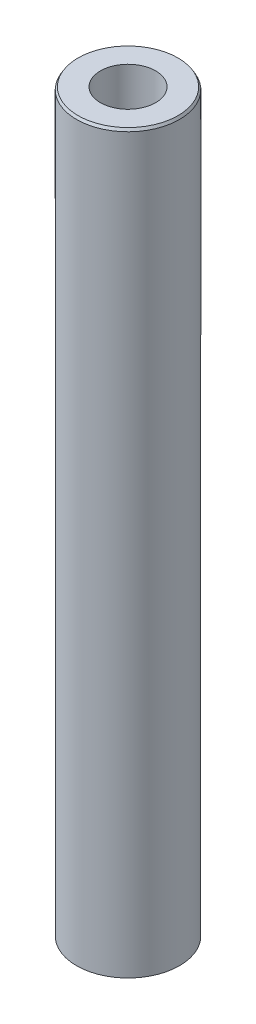
ISO-10303-21;
HEADER;
FILE_DESCRIPTION(('STEP AP214'),'2;1');
FILE_NAME('part.step','',(''),(''),'','','');
FILE_SCHEMA(('AUTOMOTIVE_DESIGN { 1 0 10303 214 1 1 1 1 }'));
ENDSEC;
DATA;
#1=APPLICATION_CONTEXT('core data for automotive mechanical design processes');
#2=APPLICATION_PROTOCOL_DEFINITION('international standard','automotive_design',2000,#1);
#3=PRODUCT_CONTEXT('',#1,'mechanical');
#4=PRODUCT('Part','Part','',(#3));
#5=PRODUCT_RELATED_PRODUCT_CATEGORY('part','',(#4));
#6=PRODUCT_DEFINITION_FORMATION('','',#4);
#7=PRODUCT_DEFINITION_CONTEXT('part definition',#1,'design');
#8=PRODUCT_DEFINITION('design','',#6,#7);
#9=PRODUCT_DEFINITION_SHAPE('','',#8);
#10=(LENGTH_UNIT() NAMED_UNIT(*) SI_UNIT(.MILLI.,.METRE.));
#11=(NAMED_UNIT(*) PLANE_ANGLE_UNIT() SI_UNIT($,.RADIAN.));
#12=(NAMED_UNIT(*) SI_UNIT($,.STERADIAN.) SOLID_ANGLE_UNIT());
#13=UNCERTAINTY_MEASURE_WITH_UNIT(LENGTH_MEASURE(1.E-05),#10,'distance_accuracy_value','');
#14=(GEOMETRIC_REPRESENTATION_CONTEXT(3) GLOBAL_UNCERTAINTY_ASSIGNED_CONTEXT((#13)) GLOBAL_UNIT_ASSIGNED_CONTEXT((#10,
#11,#12)) REPRESENTATION_CONTEXT('',''));
#15=CARTESIAN_POINT('',(0.,0.,0.));
#16=DIRECTION('',(0.,0.,1.));
#17=DIRECTION('',(1.,0.,0.));
#18=AXIS2_PLACEMENT_3D('',#15,#16,#17);
#19=CARTESIAN_POINT('',(0.,536.810664928625,0.));
#20=DIRECTION('',(0.,-1.,0.));
#21=DIRECTION('',(0.,0.,-1.));
#22=AXIS2_PLACEMENT_3D('',#19,#20,#21);
#23=CYLINDRICAL_SURFACE('',#22,37.5);
#24=CARTESIAN_POINT('',(0.,534.919867505079,0.));
#25=DIRECTION('',(0.,1.,0.));
#26=DIRECTION('',(0.,0.,1.));
#27=AXIS2_PLACEMENT_3D('',#24,#25,#26);
#28=CIRCLE('',#27,37.5);
#29=CARTESIAN_POINT('',(0.,534.919867505079,-37.5));
#30=VERTEX_POINT('',#29);
#31=EDGE_CURVE('E50',#30,#30,#28,.F.);
#32=ORIENTED_EDGE('',*,*,#31,.T.);
#33=EDGE_LOOP('',(#32));
#34=FACE_BOUND('',#33,.T.);
#35=CARTESIAN_POINT('',(0.,1.09165240146714,0.));
#36=DIRECTION('',(0.,1.,0.));
#37=DIRECTION('',(0.,0.,1.));
#38=AXIS2_PLACEMENT_3D('',#35,#36,#37);
#39=CIRCLE('',#38,37.5);
#40=CARTESIAN_POINT('',(0.,1.09165240146714,37.5));
#41=VERTEX_POINT('',#40);
#42=EDGE_CURVE('E51',#41,#41,#39,.T.);
#43=ORIENTED_EDGE('',*,*,#42,.T.);
#44=EDGE_LOOP('',(#43));
#45=FACE_BOUND('',#44,.T.);
#46=ADVANCED_FACE('F39',(#34,#45),#23,.T.);
#47=CARTESIAN_POINT('',(0.,536.810664928625,0.));
#48=DIRECTION('',(0.,1.,0.));
#49=DIRECTION('',(0.,0.,1.));
#50=AXIS2_PLACEMENT_3D('',#47,#48,#49);
#51=PLANE('',#50);
#52=CARTESIAN_POINT('',(0.,536.810664928625,0.));
#53=DIRECTION('',(0.,1.,0.));
#54=DIRECTION('',(0.,0.,1.));
#55=AXIS2_PLACEMENT_3D('',#52,#53,#54);
#56=CIRCLE('',#55,36.4083475985327);
#57=CARTESIAN_POINT('',(0.,536.810664928625,-36.4083475985328));
#58=VERTEX_POINT('',#57);
#59=EDGE_CURVE('E54',#58,#58,#56,.T.);
#60=ORIENTED_EDGE('',*,*,#59,.T.);
#61=EDGE_LOOP('',(#60));
#62=FACE_BOUND('',#61,.T.);
#63=CARTESIAN_POINT('',(0.,536.810664928625,0.));
#64=DIRECTION('',(0.,1.,0.));
#65=DIRECTION('',(0.,0.,1.));
#66=AXIS2_PLACEMENT_3D('',#63,#64,#65);
#67=CIRCLE('',#66,20.1042191089184);
#68=CARTESIAN_POINT('',(0.,536.810664928625,20.1042191089184));
#69=VERTEX_POINT('',#68);
#70=EDGE_CURVE('E58',#69,#69,#67,.T.);
#71=ORIENTED_EDGE('',*,*,#70,.F.);
#72=EDGE_LOOP('',(#71));
#73=FACE_BOUND('',#72,.T.);
#74=ADVANCED_FACE('F69',(#62,#73),#51,.T.);
#75=CARTESIAN_POINT('',(0.,0.,0.));
#76=DIRECTION('',(0.,1.,0.));
#77=DIRECTION('',(0.,0.,1.));
#78=AXIS2_PLACEMENT_3D('',#75,#76,#77);
#79=PLANE('',#78);
#80=CARTESIAN_POINT('',(0.,0.,0.));
#81=DIRECTION('',(0.,1.,0.));
#82=DIRECTION('',(0.,0.,1.));
#83=AXIS2_PLACEMENT_3D('',#80,#81,#82);
#84=CIRCLE('',#83,35.6092025764543);
#85=CARTESIAN_POINT('',(0.,0.,35.6092025764543));
#86=VERTEX_POINT('',#85);
#87=EDGE_CURVE('E10',#86,#86,#84,.F.);
#88=ORIENTED_EDGE('',*,*,#87,.T.);
#89=EDGE_LOOP('',(#88));
#90=FACE_BOUND('',#89,.T.);
#91=CARTESIAN_POINT('',(0.,0.,0.));
#92=DIRECTION('',(0.,1.,0.));
#93=DIRECTION('',(0.,0.,1.));
#94=AXIS2_PLACEMENT_3D('',#91,#92,#93);
#95=CIRCLE('',#94,20.1042191089184);
#96=CARTESIAN_POINT('',(0.,0.,20.1042191089184));
#97=VERTEX_POINT('',#96);
#98=EDGE_CURVE('E63',#97,#97,#95,.T.);
#99=ORIENTED_EDGE('',*,*,#98,.T.);
#100=EDGE_LOOP('',(#99));
#101=FACE_BOUND('',#100,.T.);
#102=ADVANCED_FACE('F75',(#90,#101),#79,.F.);
#103=CARTESIAN_POINT('',(0.,536.810664928625,0.));
#104=DIRECTION('',(0.,-1.,0.));
#105=DIRECTION('',(0.,0.,-1.));
#106=AXIS2_PLACEMENT_3D('',#103,#104,#105);
#107=CYLINDRICAL_SURFACE('',#106,20.1042191089184);
#108=ORIENTED_EDGE('',*,*,#70,.T.);
#109=EDGE_LOOP('',(#108));
#110=FACE_BOUND('',#109,.T.);
#111=ORIENTED_EDGE('',*,*,#98,.F.);
#112=EDGE_LOOP('',(#111));
#113=FACE_BOUND('',#112,.T.);
#114=ADVANCED_FACE('F70',(#110,#113),#107,.F.);
#115=CARTESIAN_POINT('',(0.,536.810664928625,0.));
#116=DIRECTION('',(0.,-1.,0.));
#117=DIRECTION('',(0.,0.,-1.));
#118=AXIS2_PLACEMENT_3D('',#115,#116,#117);
#119=CONICAL_SURFACE('',#118,36.4083475985327,0.523598775598319);
#120=CARTESIAN_POINT('',(0.,534.919867505079,-37.5));
#121=CARTESIAN_POINT('',(0.,534.939563311575,-37.4886286208181));
#122=CARTESIAN_POINT('',(0.,534.95925911807,-37.4772572416361));
#123=CARTESIAN_POINT('',(0.,534.998650731061,-37.4545144832722));
#124=CARTESIAN_POINT('',(0.,535.018346537556,-37.4431431040903));
#125=CARTESIAN_POINT('',(0.,535.057738150546,-37.4204003457264));
#126=CARTESIAN_POINT('',(0.,535.077433957042,-37.4090289665444));
#127=CARTESIAN_POINT('',(0.,535.116825570032,-37.3862862081805));
#128=CARTESIAN_POINT('',(0.,535.136521376527,-37.3749148289986));
#129=CARTESIAN_POINT('',(0.,535.175912989518,-37.3521720706347));
#130=CARTESIAN_POINT('',(0.,535.195608796013,-37.3408006914527));
#131=CARTESIAN_POINT('',(0.,535.235000409004,-37.3180579330888));
#132=CARTESIAN_POINT('',(0.,535.254696215499,-37.3066865539069));
#133=CARTESIAN_POINT('',(0.,535.29408782849,-37.283943795543));
#134=CARTESIAN_POINT('',(0.,535.313783634985,-37.272572416361));
#135=CARTESIAN_POINT('',(0.,535.353175247975,-37.2498296579971));
#136=CARTESIAN_POINT('',(0.,535.37287105447,-37.2384582788152));
#137=CARTESIAN_POINT('',(0.,535.412262667461,-37.2157155204513));
#138=CARTESIAN_POINT('',(0.,535.431958473956,-37.2043441412693));
#139=CARTESIAN_POINT('',(0.,535.471350086947,-37.1816013829054));
#140=CARTESIAN_POINT('',(0.,535.491045893442,-37.1702300037235));
#141=CARTESIAN_POINT('',(0.,535.530437506433,-37.1474872453596));
#142=CARTESIAN_POINT('',(0.,535.550133312928,-37.1361158661776));
#143=CARTESIAN_POINT('',(0.,535.589524925919,-37.1133731078137));
#144=CARTESIAN_POINT('',(0.,535.609220732414,-37.1020017286318));
#145=CARTESIAN_POINT('',(0.,535.648612345404,-37.0792589702679));
#146=CARTESIAN_POINT('',(0.,535.6683081519,-37.0678875910859));
#147=CARTESIAN_POINT('',(0.,535.70769976489,-37.045144832722));
#148=CARTESIAN_POINT('',(0.,535.727395571385,-37.0337734535401));
#149=CARTESIAN_POINT('',(0.,535.766787184376,-37.0110306951762));
#150=CARTESIAN_POINT('',(0.,535.786482990871,-36.9996593159942));
#151=CARTESIAN_POINT('',(0.,535.825874603862,-36.9769165576303));
#152=CARTESIAN_POINT('',(0.,535.845570410357,-36.9655451784483));
#153=CARTESIAN_POINT('',(0.,535.884962023348,-36.9428024200844));
#154=CARTESIAN_POINT('',(0.,535.904657829843,-36.9314310409025));
#155=CARTESIAN_POINT('',(0.,535.944049442833,-36.9086882825386));
#156=CARTESIAN_POINT('',(0.,535.963745249329,-36.8973169033566));
#157=CARTESIAN_POINT('',(0.,536.003136862319,-36.8745741449927));
#158=CARTESIAN_POINT('',(0.,536.022832668814,-36.8632027658108));
#159=CARTESIAN_POINT('',(0.,536.062224281805,-36.8404600074469));
#160=CARTESIAN_POINT('',(0.,536.0819200883,-36.8290886282649));
#161=CARTESIAN_POINT('',(0.,536.121311701291,-36.806345869901));
#162=CARTESIAN_POINT('',(0.,536.141007507786,-36.7949744907191));
#163=CARTESIAN_POINT('',(0.,536.180399120777,-36.7722317323552));
#164=CARTESIAN_POINT('',(0.,536.200094927272,-36.7608603531732));
#165=CARTESIAN_POINT('',(0.,536.239486540262,-36.7381175948093));
#166=CARTESIAN_POINT('',(0.,536.259182346758,-36.7267462156274));
#167=CARTESIAN_POINT('',(0.,536.298573959748,-36.7040034572635));
#168=CARTESIAN_POINT('',(0.,536.318269766243,-36.6926320780815));
#169=CARTESIAN_POINT('',(0.,536.357661379234,-36.6698893197176));
#170=CARTESIAN_POINT('',(0.,536.377357185729,-36.6585179405357));
#171=CARTESIAN_POINT('',(0.,536.41674879872,-36.6357751821718));
#172=CARTESIAN_POINT('',(0.,536.436444605215,-36.6244038029898));
#173=CARTESIAN_POINT('',(0.,536.475836218206,-36.6016610446259));
#174=CARTESIAN_POINT('',(0.,536.495532024701,-36.590289665444));
#175=CARTESIAN_POINT('',(0.,536.534923637691,-36.5675469070801));
#176=CARTESIAN_POINT('',(0.,536.554619444187,-36.5561755278981));
#177=CARTESIAN_POINT('',(0.,536.594011057177,-36.5334327695342));
#178=CARTESIAN_POINT('',(0.,536.613706863673,-36.5220613903523));
#179=CARTESIAN_POINT('',(0.,536.653098476663,-36.4993186319884));
#180=CARTESIAN_POINT('',(0.,536.672794283158,-36.4879472528064));
#181=CARTESIAN_POINT('',(0.,536.712185896149,-36.4652044944425));
#182=CARTESIAN_POINT('',(0.,536.731881702644,-36.4538331152606));
#183=CARTESIAN_POINT('',(0.,536.771273315635,-36.4310903568967));
#184=CARTESIAN_POINT('',(0.,536.79096912213,-36.4197189777147));
#185=CARTESIAN_POINT('',(0.,536.810664928625,-36.4083475985328));
#186=B_SPLINE_CURVE_WITH_KNOTS('',3,(#120,#121,#122,#123,#124,#125,#126,#127,#128,#129,#130,
#131,#132,#133,#134,#135,#136,#137,#138,#139,#140,#141,#142,#143,#144,#145,#146,#147,#148,#149,
#150,#151,#152,#153,#154,#155,#156,#157,#158,#159,#160,#161,#162,#163,#164,#165,#166,#167,#168,
#169,#170,#171,#172,#173,#174,#175,#176,#177,#178,#179,#180,#181,#182,#183,#184,#185),
.UNSPECIFIED.,.F.,.F.,(4,2,2,2,2,2,2,2,2,2,2,2,2,2,2,2,2,2,2,2,2,2,2,2,2,2,2,2,2,2,2,2,4),(0.,
0.0682282750917894,0.136456550183479,0.204684825275169,0.272913100366859,0.341141375458549,
0.409369650550238,0.477597925641928,0.545826200733618,0.614054475825404,0.682282750917097,
0.750511026008787,0.818739301100477,0.886967576192167,0.955195851283857,1.02342412637555,
1.09165240146724,1.15988067655903,1.22810895165072,1.29633722674241,1.3645655018341,
1.43279377692579,1.50102205201748,1.56925032710917,1.63747860220095,1.70570687729264,
1.77393515238433,1.84216342747602,1.91039170256771,1.9786199776594,2.04684825275109,
2.11507652784278,2.18330480293457),.UNSPECIFIED.);
#187=EDGE_CURVE('BSEAM81',#30,#58,#186,.T.);
#188=ORIENTED_EDGE('',*,*,#31,.F.);
#189=ORIENTED_EDGE('',*,*,#59,.F.);
#190=ORIENTED_EDGE('',*,*,#187,.T.);
#191=ORIENTED_EDGE('',*,*,#187,.F.);
#192=EDGE_LOOP('',(#188,#190,#189,#191));
#193=FACE_BOUND('',#192,.T.);
#194=ADVANCED_FACE('F81',(#193),#119,.T.);
#195=CARTESIAN_POINT('',(0.,1.09165240146714,0.));
#196=DIRECTION('',(0.,1.,0.));
#197=DIRECTION('',(0.,0.,1.));
#198=AXIS2_PLACEMENT_3D('',#195,#196,#197);
#199=CONICAL_SURFACE('',#198,37.5,1.0471975511966);
#200=ORIENTED_EDGE('',*,*,#87,.F.);
#201=EDGE_LOOP('',(#200));
#202=FACE_BOUND('',#201,.T.);
#203=ORIENTED_EDGE('',*,*,#42,.F.);
#204=EDGE_LOOP('',(#203));
#205=FACE_BOUND('',#204,.T.);
#206=ADVANCED_FACE('F45',(#202,#205),#199,.T.);
#207=CLOSED_SHELL('',(#46,#74,#102,#114,#194,#206));
#208=MANIFOLD_SOLID_BREP('B2',#207);
#209=ADVANCED_BREP_SHAPE_REPRESENTATION('',(#18,#208),#14);
#210=SHAPE_DEFINITION_REPRESENTATION(#9,#209);
ENDSEC;
END-ISO-10303-21;
